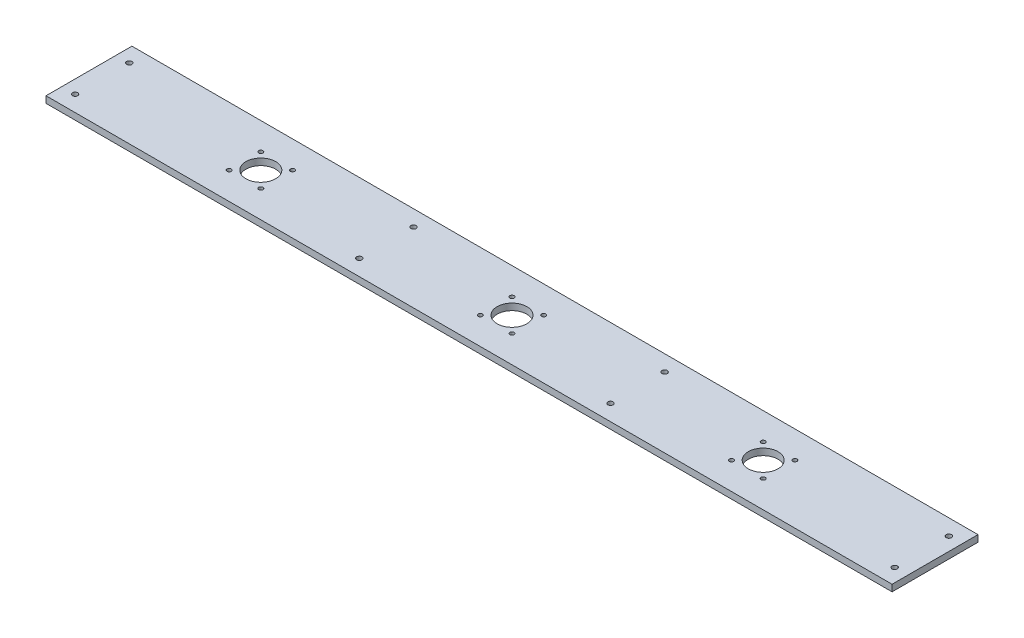
ISO-10303-21;
HEADER;
FILE_DESCRIPTION(('STEP AP214'),'2;1');
FILE_NAME('part.step','',(''),(''),'','','');
FILE_SCHEMA(('AUTOMOTIVE_DESIGN { 1 0 10303 214 1 1 1 1 }'));
ENDSEC;
DATA;
#1=APPLICATION_CONTEXT('core data for automotive mechanical design processes');
#2=APPLICATION_PROTOCOL_DEFINITION('international standard','automotive_design',2000,#1);
#3=PRODUCT_CONTEXT('',#1,'mechanical');
#4=PRODUCT('Part','Part','',(#3));
#5=PRODUCT_RELATED_PRODUCT_CATEGORY('part','',(#4));
#6=PRODUCT_DEFINITION_FORMATION('','',#4);
#7=PRODUCT_DEFINITION_CONTEXT('part definition',#1,'design');
#8=PRODUCT_DEFINITION('design','',#6,#7);
#9=PRODUCT_DEFINITION_SHAPE('','',#8);
#10=(LENGTH_UNIT() NAMED_UNIT(*) SI_UNIT(.MILLI.,.METRE.));
#11=(NAMED_UNIT(*) PLANE_ANGLE_UNIT() SI_UNIT($,.RADIAN.));
#12=(NAMED_UNIT(*) SI_UNIT($,.STERADIAN.) SOLID_ANGLE_UNIT());
#13=UNCERTAINTY_MEASURE_WITH_UNIT(LENGTH_MEASURE(1.E-05),#10,'distance_accuracy_value','');
#14=(GEOMETRIC_REPRESENTATION_CONTEXT(3) GLOBAL_UNCERTAINTY_ASSIGNED_CONTEXT((#13)) GLOBAL_UNIT_ASSIGNED_CONTEXT((#10,
#11,#12)) REPRESENTATION_CONTEXT('',''));
#15=CARTESIAN_POINT('',(0.,0.,0.));
#16=DIRECTION('',(0.,0.,1.));
#17=DIRECTION('',(1.,0.,0.));
#18=AXIS2_PLACEMENT_3D('',#15,#16,#17);
#19=CARTESIAN_POINT('',(0.,-6.35,0.));
#20=DIRECTION('',(0.,-1.,0.));
#21=DIRECTION('',(0.,0.,-1.));
#22=AXIS2_PLACEMENT_3D('',#19,#20,#21);
#23=PLANE('',#22);
#24=CARTESIAN_POINT('',(256.54,-6.34999999999764,-15.24));
#25=DIRECTION('',(0.,1.,0.));
#26=DIRECTION('',(0.,0.,1.));
#27=AXIS2_PLACEMENT_3D('',#24,#25,#26);
#28=CIRCLE('',#27,2.032);
#29=CARTESIAN_POINT('',(256.54,-6.34999999999764,-13.208));
#30=VERTEX_POINT('',#29);
#31=EDGE_CURVE('E191',#30,#30,#28,.T.);
#32=ORIENTED_EDGE('',*,*,#31,.T.);
#33=EDGE_LOOP('',(#32));
#34=FACE_BOUND('',#33,.T.);
#35=CARTESIAN_POINT('',(226.06,-6.34999999999764,15.24));
#36=DIRECTION('',(0.,1.,0.));
#37=DIRECTION('',(0.,0.,1.));
#38=AXIS2_PLACEMENT_3D('',#35,#36,#37);
#39=CIRCLE('',#38,2.032);
#40=CARTESIAN_POINT('',(226.06,-6.34999999999764,17.272));
#41=VERTEX_POINT('',#40);
#42=EDGE_CURVE('E185',#41,#41,#39,.T.);
#43=ORIENTED_EDGE('',*,*,#42,.T.);
#44=EDGE_LOOP('',(#43));
#45=FACE_BOUND('',#44,.T.);
#46=CARTESIAN_POINT('',(241.3,-6.34999999999764,0.));
#47=DIRECTION('',(0.,1.,0.));
#48=DIRECTION('',(0.,0.,1.));
#49=AXIS2_PLACEMENT_3D('',#46,#47,#48);
#50=CIRCLE('',#49,14.2875);
#51=CARTESIAN_POINT('',(241.3,-6.34999999999764,14.2875));
#52=VERTEX_POINT('',#51);
#53=EDGE_CURVE('E179',#52,#52,#50,.T.);
#54=ORIENTED_EDGE('',*,*,#53,.T.);
#55=EDGE_LOOP('',(#54));
#56=FACE_BOUND('',#55,.T.);
#57=CARTESIAN_POINT('',(-15.24,-6.34999999999764,-15.24));
#58=DIRECTION('',(0.,1.,0.));
#59=DIRECTION('',(0.,0.,1.));
#60=AXIS2_PLACEMENT_3D('',#57,#58,#59);
#61=CIRCLE('',#60,2.032);
#62=CARTESIAN_POINT('',(-15.24,-6.34999999999764,-13.208));
#63=VERTEX_POINT('',#62);
#64=EDGE_CURVE('E176',#63,#63,#61,.T.);
#65=ORIENTED_EDGE('',*,*,#64,.T.);
#66=EDGE_LOOP('',(#65));
#67=FACE_BOUND('',#66,.T.);
#68=CARTESIAN_POINT('',(-15.24,-6.34999999999764,15.24));
#69=DIRECTION('',(0.,1.,0.));
#70=DIRECTION('',(0.,0.,1.));
#71=AXIS2_PLACEMENT_3D('',#68,#69,#70);
#72=CIRCLE('',#71,2.032);
#73=CARTESIAN_POINT('',(-15.24,-6.34999999999764,17.272));
#74=VERTEX_POINT('',#73);
#75=EDGE_CURVE('E173',#74,#74,#72,.T.);
#76=ORIENTED_EDGE('',*,*,#75,.T.);
#77=EDGE_LOOP('',(#76));
#78=FACE_BOUND('',#77,.T.);
#79=CARTESIAN_POINT('',(15.24,-6.34999999999764,15.24));
#80=DIRECTION('',(0.,1.,0.));
#81=DIRECTION('',(0.,0.,1.));
#82=AXIS2_PLACEMENT_3D('',#79,#80,#81);
#83=CIRCLE('',#82,2.032);
#84=CARTESIAN_POINT('',(15.24,-6.34999999999764,17.272));
#85=VERTEX_POINT('',#84);
#86=EDGE_CURVE('E170',#85,#85,#83,.T.);
#87=ORIENTED_EDGE('',*,*,#86,.T.);
#88=EDGE_LOOP('',(#87));
#89=FACE_BOUND('',#88,.T.);
#90=CARTESIAN_POINT('',(15.24,-6.34999999999764,-15.24));
#91=DIRECTION('',(0.,1.,0.));
#92=DIRECTION('',(0.,0.,1.));
#93=AXIS2_PLACEMENT_3D('',#90,#91,#92);
#94=CIRCLE('',#93,2.032);
#95=CARTESIAN_POINT('',(15.24,-6.34999999999764,-13.208));
#96=VERTEX_POINT('',#95);
#97=EDGE_CURVE('E167',#96,#96,#94,.T.);
#98=ORIENTED_EDGE('',*,*,#97,.T.);
#99=EDGE_LOOP('',(#98));
#100=FACE_BOUND('',#99,.T.);
#101=CARTESIAN_POINT('',(-256.54,-6.34999999999764,-15.24));
#102=DIRECTION('',(0.,1.,0.));
#103=DIRECTION('',(0.,0.,1.));
#104=AXIS2_PLACEMENT_3D('',#101,#102,#103);
#105=CIRCLE('',#104,2.032);
#106=CARTESIAN_POINT('',(-256.54,-6.34999999999764,-13.208));
#107=VERTEX_POINT('',#106);
#108=EDGE_CURVE('E164',#107,#107,#105,.T.);
#109=ORIENTED_EDGE('',*,*,#108,.T.);
#110=EDGE_LOOP('',(#109));
#111=FACE_BOUND('',#110,.T.);
#112=CARTESIAN_POINT('',(-226.06,-6.34999999999764,-15.24));
#113=DIRECTION('',(0.,1.,0.));
#114=DIRECTION('',(0.,0.,1.));
#115=AXIS2_PLACEMENT_3D('',#112,#113,#114);
#116=CIRCLE('',#115,2.032);
#117=CARTESIAN_POINT('',(-226.06,-6.34999999999764,-13.208));
#118=VERTEX_POINT('',#117);
#119=EDGE_CURVE('E161',#118,#118,#116,.T.);
#120=ORIENTED_EDGE('',*,*,#119,.T.);
#121=EDGE_LOOP('',(#120));
#122=FACE_BOUND('',#121,.T.);
#123=CARTESIAN_POINT('',(-226.06,-6.34999999999764,15.24));
#124=DIRECTION('',(0.,1.,0.));
#125=DIRECTION('',(0.,0.,1.));
#126=AXIS2_PLACEMENT_3D('',#123,#124,#125);
#127=CIRCLE('',#126,2.032);
#128=CARTESIAN_POINT('',(-226.06,-6.34999999999764,17.272));
#129=VERTEX_POINT('',#128);
#130=EDGE_CURVE('E158',#129,#129,#127,.T.);
#131=ORIENTED_EDGE('',*,*,#130,.T.);
#132=EDGE_LOOP('',(#131));
#133=FACE_BOUND('',#132,.T.);
#134=CARTESIAN_POINT('',(0.,-6.34999999999764,0.));
#135=DIRECTION('',(0.,1.,0.));
#136=DIRECTION('',(0.,0.,1.));
#137=AXIS2_PLACEMENT_3D('',#134,#135,#136);
#138=CIRCLE('',#137,14.2875);
#139=CARTESIAN_POINT('',(0.,-6.34999999999764,14.2875));
#140=VERTEX_POINT('',#139);
#141=EDGE_CURVE('E155',#140,#140,#138,.T.);
#142=ORIENTED_EDGE('',*,*,#141,.T.);
#143=EDGE_LOOP('',(#142));
#144=FACE_BOUND('',#143,.T.);
#145=CARTESIAN_POINT('',(-256.54,-6.34999999999764,15.24));
#146=DIRECTION('',(0.,1.,0.));
#147=DIRECTION('',(0.,0.,1.));
#148=AXIS2_PLACEMENT_3D('',#145,#146,#147);
#149=CIRCLE('',#148,2.032);
#150=CARTESIAN_POINT('',(-256.54,-6.34999999999764,17.272));
#151=VERTEX_POINT('',#150);
#152=EDGE_CURVE('E152',#151,#151,#149,.T.);
#153=ORIENTED_EDGE('',*,*,#152,.T.);
#154=EDGE_LOOP('',(#153));
#155=FACE_BOUND('',#154,.T.);
#156=CARTESIAN_POINT('',(-241.3,-6.34999999999764,0.));
#157=DIRECTION('',(0.,1.,0.));
#158=DIRECTION('',(0.,0.,1.));
#159=AXIS2_PLACEMENT_3D('',#156,#157,#158);
#160=CIRCLE('',#159,14.2875);
#161=CARTESIAN_POINT('',(-241.3,-6.34999999999764,14.2875));
#162=VERTEX_POINT('',#161);
#163=EDGE_CURVE('E66',#162,#162,#160,.T.);
#164=ORIENTED_EDGE('',*,*,#163,.T.);
#165=EDGE_LOOP('',(#164));
#166=FACE_BOUND('',#165,.T.);
#167=DIRECTION('',(-1.,0.,0.));
#168=VECTOR('',#167,1.);
#169=CARTESIAN_POINT('',(-299.116079656319,-6.35,41.275));
#170=LINE('',#169,#168);
#171=CARTESIAN_POINT('',(406.4,-6.35,41.275));
#172=VERTEX_POINT('',#171);
#173=CARTESIAN_POINT('',(-406.4,-6.35,41.275));
#174=VERTEX_POINT('',#173);
#175=EDGE_CURVE('E55',#172,#174,#170,.T.);
#176=ORIENTED_EDGE('',*,*,#175,.T.);
#177=DIRECTION('',(0.,0.,-1.));
#178=VECTOR('',#177,1.);
#179=CARTESIAN_POINT('',(-406.4,-6.35,9.525));
#180=LINE('',#179,#178);
#181=CARTESIAN_POINT('',(-406.4,-6.35,-41.275));
#182=VERTEX_POINT('',#181);
#183=EDGE_CURVE('E619',#174,#182,#180,.T.);
#184=ORIENTED_EDGE('',*,*,#183,.T.);
#185=DIRECTION('',(-1.,0.,0.));
#186=VECTOR('',#185,1.);
#187=CARTESIAN_POINT('',(0.,-6.35,-41.275));
#188=LINE('',#187,#186);
#189=CARTESIAN_POINT('',(406.4,-6.35,-41.275));
#190=VERTEX_POINT('',#189);
#191=EDGE_CURVE('E60',#190,#182,#188,.T.);
#192=ORIENTED_EDGE('',*,*,#191,.F.);
#193=DIRECTION('',(0.,0.,-1.));
#194=VECTOR('',#193,1.);
#195=CARTESIAN_POINT('',(406.4,-6.35,9.52499999999979));
#196=LINE('',#195,#194);
#197=EDGE_CURVE('E58',#172,#190,#196,.T.);
#198=ORIENTED_EDGE('',*,*,#197,.F.);
#199=EDGE_LOOP('',(#176,#184,#192,#198));
#200=FACE_BOUND('',#199,.T.);
#201=CARTESIAN_POINT('',(256.54,-6.34999999999764,15.24));
#202=DIRECTION('',(0.,1.,0.));
#203=DIRECTION('',(0.,0.,1.));
#204=AXIS2_PLACEMENT_3D('',#201,#202,#203);
#205=CIRCLE('',#204,2.032);
#206=CARTESIAN_POINT('',(256.54,-6.34999999999764,17.272));
#207=VERTEX_POINT('',#206);
#208=EDGE_CURVE('E182',#207,#207,#205,.T.);
#209=ORIENTED_EDGE('',*,*,#208,.T.);
#210=EDGE_LOOP('',(#209));
#211=FACE_BOUND('',#210,.T.);
#212=CARTESIAN_POINT('',(226.06,-6.34999999999764,-15.24));
#213=DIRECTION('',(0.,1.,0.));
#214=DIRECTION('',(0.,0.,1.));
#215=AXIS2_PLACEMENT_3D('',#212,#213,#214);
#216=CIRCLE('',#215,2.032);
#217=CARTESIAN_POINT('',(226.06,-6.34999999999764,-13.208));
#218=VERTEX_POINT('',#217);
#219=EDGE_CURVE('E188',#218,#218,#216,.T.);
#220=ORIENTED_EDGE('',*,*,#219,.T.);
#221=EDGE_LOOP('',(#220));
#222=FACE_BOUND('',#221,.T.);
#223=CARTESIAN_POINT('',(-393.7,-6.34999999999764,-26.035));
#224=DIRECTION('',(0.,1.,0.));
#225=DIRECTION('',(0.,0.,1.));
#226=AXIS2_PLACEMENT_3D('',#223,#224,#225);
#227=CIRCLE('',#226,2.54);
#228=CARTESIAN_POINT('',(-393.7,-6.34999999999764,-23.495));
#229=VERTEX_POINT('',#228);
#230=EDGE_CURVE('E194',#229,#229,#227,.T.);
#231=ORIENTED_EDGE('',*,*,#230,.T.);
#232=EDGE_LOOP('',(#231));
#233=FACE_BOUND('',#232,.T.);
#234=CARTESIAN_POINT('',(-120.65,-6.34999999999764,26.035));
#235=DIRECTION('',(0.,1.,0.));
#236=DIRECTION('',(0.,0.,1.));
#237=AXIS2_PLACEMENT_3D('',#234,#235,#236);
#238=CIRCLE('',#237,2.54);
#239=CARTESIAN_POINT('',(-120.65,-6.34999999999764,28.575));
#240=VERTEX_POINT('',#239);
#241=EDGE_CURVE('E197',#240,#240,#238,.T.);
#242=ORIENTED_EDGE('',*,*,#241,.T.);
#243=EDGE_LOOP('',(#242));
#244=FACE_BOUND('',#243,.T.);
#245=CARTESIAN_POINT('',(-120.65,-6.34999999999764,-26.035));
#246=DIRECTION('',(0.,1.,0.));
#247=DIRECTION('',(0.,0.,1.));
#248=AXIS2_PLACEMENT_3D('',#245,#246,#247);
#249=CIRCLE('',#248,2.54);
#250=CARTESIAN_POINT('',(-120.65,-6.34999999999764,-23.495));
#251=VERTEX_POINT('',#250);
#252=EDGE_CURVE('E200',#251,#251,#249,.T.);
#253=ORIENTED_EDGE('',*,*,#252,.T.);
#254=EDGE_LOOP('',(#253));
#255=FACE_BOUND('',#254,.T.);
#256=CARTESIAN_POINT('',(-393.7,-6.34999999999764,26.035));
#257=DIRECTION('',(0.,1.,0.));
#258=DIRECTION('',(0.,0.,1.));
#259=AXIS2_PLACEMENT_3D('',#256,#257,#258);
#260=CIRCLE('',#259,2.54);
#261=CARTESIAN_POINT('',(-393.7,-6.34999999999764,28.575));
#262=VERTEX_POINT('',#261);
#263=EDGE_CURVE('E203',#262,#262,#260,.T.);
#264=ORIENTED_EDGE('',*,*,#263,.T.);
#265=EDGE_LOOP('',(#264));
#266=FACE_BOUND('',#265,.T.);
#267=CARTESIAN_POINT('',(393.7,-6.34999999999764,-26.035));
#268=DIRECTION('',(0.,1.,0.));
#269=DIRECTION('',(0.,0.,1.));
#270=AXIS2_PLACEMENT_3D('',#267,#268,#269);
#271=CIRCLE('',#270,2.54);
#272=CARTESIAN_POINT('',(393.7,-6.34999999999764,-23.495));
#273=VERTEX_POINT('',#272);
#274=EDGE_CURVE('E206',#273,#273,#271,.T.);
#275=ORIENTED_EDGE('',*,*,#274,.T.);
#276=EDGE_LOOP('',(#275));
#277=FACE_BOUND('',#276,.T.);
#278=CARTESIAN_POINT('',(120.65,-6.34999999999764,26.035));
#279=DIRECTION('',(0.,1.,0.));
#280=DIRECTION('',(0.,0.,1.));
#281=AXIS2_PLACEMENT_3D('',#278,#279,#280);
#282=CIRCLE('',#281,2.54);
#283=CARTESIAN_POINT('',(120.65,-6.34999999999764,28.575));
#284=VERTEX_POINT('',#283);
#285=EDGE_CURVE('E209',#284,#284,#282,.T.);
#286=ORIENTED_EDGE('',*,*,#285,.T.);
#287=EDGE_LOOP('',(#286));
#288=FACE_BOUND('',#287,.T.);
#289=CARTESIAN_POINT('',(120.65,-6.34999999999764,-26.035));
#290=DIRECTION('',(0.,1.,0.));
#291=DIRECTION('',(0.,0.,1.));
#292=AXIS2_PLACEMENT_3D('',#289,#290,#291);
#293=CIRCLE('',#292,2.54);
#294=CARTESIAN_POINT('',(120.65,-6.34999999999764,-23.495));
#295=VERTEX_POINT('',#294);
#296=EDGE_CURVE('E211',#295,#295,#293,.T.);
#297=ORIENTED_EDGE('',*,*,#296,.T.);
#298=EDGE_LOOP('',(#297));
#299=FACE_BOUND('',#298,.T.);
#300=CARTESIAN_POINT('',(393.7,-6.34999999999764,26.035));
#301=DIRECTION('',(0.,1.,0.));
#302=DIRECTION('',(0.,0.,1.));
#303=AXIS2_PLACEMENT_3D('',#300,#301,#302);
#304=CIRCLE('',#303,2.54);
#305=CARTESIAN_POINT('',(393.7,-6.34999999999764,28.575));
#306=VERTEX_POINT('',#305);
#307=EDGE_CURVE('E20',#306,#306,#304,.T.);
#308=ORIENTED_EDGE('',*,*,#307,.T.);
#309=EDGE_LOOP('',(#308));
#310=FACE_BOUND('',#309,.T.);
#311=ADVANCED_FACE('F17',(#34,#45,#56,#67,#78,#89,#100,#111,#122,#133,#144,#155,#166,#200,#211,
#222,#233,#244,#255,#266,#277,#288,#299,#310),#23,.T.);
#312=CARTESIAN_POINT('',(393.7,500000.,26.035));
#313=DIRECTION('',(0.,1.,0.));
#314=DIRECTION('',(0.,0.,1.));
#315=AXIS2_PLACEMENT_3D('',#312,#313,#314);
#316=CYLINDRICAL_SURFACE('',#315,2.54);
#317=ORIENTED_EDGE('',*,*,#307,.F.);
#318=EDGE_LOOP('',(#317));
#319=FACE_BOUND('',#318,.T.);
#320=CARTESIAN_POINT('',(393.7,0.,26.035));
#321=DIRECTION('',(0.,1.,0.));
#322=DIRECTION('',(0.,0.,1.));
#323=AXIS2_PLACEMENT_3D('',#320,#321,#322);
#324=CIRCLE('',#323,2.54);
#325=CARTESIAN_POINT('',(393.7,0.,28.575));
#326=VERTEX_POINT('',#325);
#327=EDGE_CURVE('E147',#326,#326,#324,.T.);
#328=ORIENTED_EDGE('',*,*,#327,.T.);
#329=EDGE_LOOP('',(#328));
#330=FACE_BOUND('',#329,.T.);
#331=ADVANCED_FACE('F219',(#319,#330),#316,.F.);
#332=CARTESIAN_POINT('',(120.65,500000.,-26.035));
#333=DIRECTION('',(0.,1.,0.));
#334=DIRECTION('',(0.,0.,1.));
#335=AXIS2_PLACEMENT_3D('',#332,#333,#334);
#336=CYLINDRICAL_SURFACE('',#335,2.54);
#337=ORIENTED_EDGE('',*,*,#296,.F.);
#338=EDGE_LOOP('',(#337));
#339=FACE_BOUND('',#338,.T.);
#340=CARTESIAN_POINT('',(120.65,0.,-26.035));
#341=DIRECTION('',(0.,1.,0.));
#342=DIRECTION('',(0.,0.,1.));
#343=AXIS2_PLACEMENT_3D('',#340,#341,#342);
#344=CIRCLE('',#343,2.54);
#345=CARTESIAN_POINT('',(120.65,0.,-23.495));
#346=VERTEX_POINT('',#345);
#347=EDGE_CURVE('E144',#346,#346,#344,.T.);
#348=ORIENTED_EDGE('',*,*,#347,.T.);
#349=EDGE_LOOP('',(#348));
#350=FACE_BOUND('',#349,.T.);
#351=ADVANCED_FACE('F222',(#339,#350),#336,.F.);
#352=CARTESIAN_POINT('',(120.65,500000.,26.035));
#353=DIRECTION('',(0.,1.,0.));
#354=DIRECTION('',(0.,0.,1.));
#355=AXIS2_PLACEMENT_3D('',#352,#353,#354);
#356=CYLINDRICAL_SURFACE('',#355,2.54);
#357=ORIENTED_EDGE('',*,*,#285,.F.);
#358=EDGE_LOOP('',(#357));
#359=FACE_BOUND('',#358,.T.);
#360=CARTESIAN_POINT('',(120.65,0.,26.035));
#361=DIRECTION('',(0.,1.,0.));
#362=DIRECTION('',(0.,0.,1.));
#363=AXIS2_PLACEMENT_3D('',#360,#361,#362);
#364=CIRCLE('',#363,2.54);
#365=CARTESIAN_POINT('',(120.65,0.,28.575));
#366=VERTEX_POINT('',#365);
#367=EDGE_CURVE('E141',#366,#366,#364,.T.);
#368=ORIENTED_EDGE('',*,*,#367,.T.);
#369=EDGE_LOOP('',(#368));
#370=FACE_BOUND('',#369,.T.);
#371=ADVANCED_FACE('F325',(#359,#370),#356,.F.);
#372=CARTESIAN_POINT('',(393.7,500000.,-26.035));
#373=DIRECTION('',(0.,1.,0.));
#374=DIRECTION('',(0.,0.,1.));
#375=AXIS2_PLACEMENT_3D('',#372,#373,#374);
#376=CYLINDRICAL_SURFACE('',#375,2.54);
#377=ORIENTED_EDGE('',*,*,#274,.F.);
#378=EDGE_LOOP('',(#377));
#379=FACE_BOUND('',#378,.T.);
#380=CARTESIAN_POINT('',(393.7,0.,-26.035));
#381=DIRECTION('',(0.,1.,0.));
#382=DIRECTION('',(0.,0.,1.));
#383=AXIS2_PLACEMENT_3D('',#380,#381,#382);
#384=CIRCLE('',#383,2.54);
#385=CARTESIAN_POINT('',(393.7,0.,-23.495));
#386=VERTEX_POINT('',#385);
#387=EDGE_CURVE('E138',#386,#386,#384,.T.);
#388=ORIENTED_EDGE('',*,*,#387,.T.);
#389=EDGE_LOOP('',(#388));
#390=FACE_BOUND('',#389,.T.);
#391=ADVANCED_FACE('F321',(#379,#390),#376,.F.);
#392=CARTESIAN_POINT('',(-393.7,500000.,26.035));
#393=DIRECTION('',(0.,1.,0.));
#394=DIRECTION('',(0.,0.,1.));
#395=AXIS2_PLACEMENT_3D('',#392,#393,#394);
#396=CYLINDRICAL_SURFACE('',#395,2.54);
#397=ORIENTED_EDGE('',*,*,#263,.F.);
#398=EDGE_LOOP('',(#397));
#399=FACE_BOUND('',#398,.T.);
#400=CARTESIAN_POINT('',(-393.7,0.,26.035));
#401=DIRECTION('',(0.,1.,0.));
#402=DIRECTION('',(0.,0.,1.));
#403=AXIS2_PLACEMENT_3D('',#400,#401,#402);
#404=CIRCLE('',#403,2.54);
#405=CARTESIAN_POINT('',(-393.7,0.,28.575));
#406=VERTEX_POINT('',#405);
#407=EDGE_CURVE('E135',#406,#406,#404,.T.);
#408=ORIENTED_EDGE('',*,*,#407,.T.);
#409=EDGE_LOOP('',(#408));
#410=FACE_BOUND('',#409,.T.);
#411=ADVANCED_FACE('F317',(#399,#410),#396,.F.);
#412=CARTESIAN_POINT('',(-120.65,500000.,-26.035));
#413=DIRECTION('',(0.,1.,0.));
#414=DIRECTION('',(0.,0.,1.));
#415=AXIS2_PLACEMENT_3D('',#412,#413,#414);
#416=CYLINDRICAL_SURFACE('',#415,2.54);
#417=ORIENTED_EDGE('',*,*,#252,.F.);
#418=EDGE_LOOP('',(#417));
#419=FACE_BOUND('',#418,.T.);
#420=CARTESIAN_POINT('',(-120.65,0.,-26.035));
#421=DIRECTION('',(0.,1.,0.));
#422=DIRECTION('',(0.,0.,1.));
#423=AXIS2_PLACEMENT_3D('',#420,#421,#422);
#424=CIRCLE('',#423,2.54);
#425=CARTESIAN_POINT('',(-120.65,0.,-23.495));
#426=VERTEX_POINT('',#425);
#427=EDGE_CURVE('E132',#426,#426,#424,.T.);
#428=ORIENTED_EDGE('',*,*,#427,.T.);
#429=EDGE_LOOP('',(#428));
#430=FACE_BOUND('',#429,.T.);
#431=ADVANCED_FACE('F313',(#419,#430),#416,.F.);
#432=CARTESIAN_POINT('',(-120.65,500000.,26.035));
#433=DIRECTION('',(0.,1.,0.));
#434=DIRECTION('',(0.,0.,1.));
#435=AXIS2_PLACEMENT_3D('',#432,#433,#434);
#436=CYLINDRICAL_SURFACE('',#435,2.54);
#437=ORIENTED_EDGE('',*,*,#241,.F.);
#438=EDGE_LOOP('',(#437));
#439=FACE_BOUND('',#438,.T.);
#440=CARTESIAN_POINT('',(-120.65,0.,26.035));
#441=DIRECTION('',(0.,1.,0.));
#442=DIRECTION('',(0.,0.,1.));
#443=AXIS2_PLACEMENT_3D('',#440,#441,#442);
#444=CIRCLE('',#443,2.54);
#445=CARTESIAN_POINT('',(-120.65,0.,28.575));
#446=VERTEX_POINT('',#445);
#447=EDGE_CURVE('E129',#446,#446,#444,.T.);
#448=ORIENTED_EDGE('',*,*,#447,.T.);
#449=EDGE_LOOP('',(#448));
#450=FACE_BOUND('',#449,.T.);
#451=ADVANCED_FACE('F309',(#439,#450),#436,.F.);
#452=CARTESIAN_POINT('',(-393.7,500000.,-26.035));
#453=DIRECTION('',(0.,1.,0.));
#454=DIRECTION('',(0.,0.,1.));
#455=AXIS2_PLACEMENT_3D('',#452,#453,#454);
#456=CYLINDRICAL_SURFACE('',#455,2.54);
#457=ORIENTED_EDGE('',*,*,#230,.F.);
#458=EDGE_LOOP('',(#457));
#459=FACE_BOUND('',#458,.T.);
#460=CARTESIAN_POINT('',(-393.7,0.,-26.035));
#461=DIRECTION('',(0.,1.,0.));
#462=DIRECTION('',(0.,0.,1.));
#463=AXIS2_PLACEMENT_3D('',#460,#461,#462);
#464=CIRCLE('',#463,2.54);
#465=CARTESIAN_POINT('',(-393.7,0.,-23.495));
#466=VERTEX_POINT('',#465);
#467=EDGE_CURVE('E126',#466,#466,#464,.T.);
#468=ORIENTED_EDGE('',*,*,#467,.T.);
#469=EDGE_LOOP('',(#468));
#470=FACE_BOUND('',#469,.T.);
#471=ADVANCED_FACE('F305',(#459,#470),#456,.F.);
#472=CARTESIAN_POINT('',(256.54,500000.,-15.24));
#473=DIRECTION('',(0.,1.,0.));
#474=DIRECTION('',(0.,0.,1.));
#475=AXIS2_PLACEMENT_3D('',#472,#473,#474);
#476=CYLINDRICAL_SURFACE('',#475,2.032);
#477=ORIENTED_EDGE('',*,*,#31,.F.);
#478=EDGE_LOOP('',(#477));
#479=FACE_BOUND('',#478,.T.);
#480=CARTESIAN_POINT('',(256.54,0.,-15.24));
#481=DIRECTION('',(0.,1.,0.));
#482=DIRECTION('',(0.,0.,1.));
#483=AXIS2_PLACEMENT_3D('',#480,#481,#482);
#484=CIRCLE('',#483,2.032);
#485=CARTESIAN_POINT('',(256.54,0.,-13.208));
#486=VERTEX_POINT('',#485);
#487=EDGE_CURVE('E123',#486,#486,#484,.T.);
#488=ORIENTED_EDGE('',*,*,#487,.T.);
#489=EDGE_LOOP('',(#488));
#490=FACE_BOUND('',#489,.T.);
#491=ADVANCED_FACE('F301',(#479,#490),#476,.F.);
#492=CARTESIAN_POINT('',(226.06,500000.,-15.24));
#493=DIRECTION('',(0.,1.,0.));
#494=DIRECTION('',(0.,0.,1.));
#495=AXIS2_PLACEMENT_3D('',#492,#493,#494);
#496=CYLINDRICAL_SURFACE('',#495,2.032);
#497=ORIENTED_EDGE('',*,*,#219,.F.);
#498=EDGE_LOOP('',(#497));
#499=FACE_BOUND('',#498,.T.);
#500=CARTESIAN_POINT('',(226.06,0.,-15.24));
#501=DIRECTION('',(0.,1.,0.));
#502=DIRECTION('',(0.,0.,1.));
#503=AXIS2_PLACEMENT_3D('',#500,#501,#502);
#504=CIRCLE('',#503,2.032);
#505=CARTESIAN_POINT('',(226.06,0.,-13.208));
#506=VERTEX_POINT('',#505);
#507=EDGE_CURVE('E120',#506,#506,#504,.T.);
#508=ORIENTED_EDGE('',*,*,#507,.T.);
#509=EDGE_LOOP('',(#508));
#510=FACE_BOUND('',#509,.T.);
#511=ADVANCED_FACE('F297',(#499,#510),#496,.F.);
#512=CARTESIAN_POINT('',(226.06,500000.,15.24));
#513=DIRECTION('',(0.,1.,0.));
#514=DIRECTION('',(0.,0.,1.));
#515=AXIS2_PLACEMENT_3D('',#512,#513,#514);
#516=CYLINDRICAL_SURFACE('',#515,2.032);
#517=ORIENTED_EDGE('',*,*,#42,.F.);
#518=EDGE_LOOP('',(#517));
#519=FACE_BOUND('',#518,.T.);
#520=CARTESIAN_POINT('',(226.06,0.,15.24));
#521=DIRECTION('',(0.,1.,0.));
#522=DIRECTION('',(0.,0.,1.));
#523=AXIS2_PLACEMENT_3D('',#520,#521,#522);
#524=CIRCLE('',#523,2.032);
#525=CARTESIAN_POINT('',(226.06,0.,17.272));
#526=VERTEX_POINT('',#525);
#527=EDGE_CURVE('E117',#526,#526,#524,.T.);
#528=ORIENTED_EDGE('',*,*,#527,.T.);
#529=EDGE_LOOP('',(#528));
#530=FACE_BOUND('',#529,.T.);
#531=ADVANCED_FACE('F293',(#519,#530),#516,.F.);
#532=CARTESIAN_POINT('',(256.54,500000.,15.24));
#533=DIRECTION('',(0.,1.,0.));
#534=DIRECTION('',(0.,0.,1.));
#535=AXIS2_PLACEMENT_3D('',#532,#533,#534);
#536=CYLINDRICAL_SURFACE('',#535,2.032);
#537=ORIENTED_EDGE('',*,*,#208,.F.);
#538=EDGE_LOOP('',(#537));
#539=FACE_BOUND('',#538,.T.);
#540=CARTESIAN_POINT('',(256.54,0.,15.24));
#541=DIRECTION('',(0.,1.,0.));
#542=DIRECTION('',(0.,0.,1.));
#543=AXIS2_PLACEMENT_3D('',#540,#541,#542);
#544=CIRCLE('',#543,2.032);
#545=CARTESIAN_POINT('',(256.54,0.,17.272));
#546=VERTEX_POINT('',#545);
#547=EDGE_CURVE('E114',#546,#546,#544,.T.);
#548=ORIENTED_EDGE('',*,*,#547,.T.);
#549=EDGE_LOOP('',(#548));
#550=FACE_BOUND('',#549,.T.);
#551=ADVANCED_FACE('F289',(#539,#550),#536,.F.);
#552=CARTESIAN_POINT('',(241.3,500000.,0.));
#553=DIRECTION('',(0.,1.,0.));
#554=DIRECTION('',(0.,0.,1.));
#555=AXIS2_PLACEMENT_3D('',#552,#553,#554);
#556=CYLINDRICAL_SURFACE('',#555,14.2875);
#557=ORIENTED_EDGE('',*,*,#53,.F.);
#558=EDGE_LOOP('',(#557));
#559=FACE_BOUND('',#558,.T.);
#560=CARTESIAN_POINT('',(241.3,0.,0.));
#561=DIRECTION('',(0.,1.,0.));
#562=DIRECTION('',(0.,0.,1.));
#563=AXIS2_PLACEMENT_3D('',#560,#561,#562);
#564=CIRCLE('',#563,14.2875);
#565=CARTESIAN_POINT('',(241.3,0.,14.2875));
#566=VERTEX_POINT('',#565);
#567=EDGE_CURVE('E111',#566,#566,#564,.T.);
#568=ORIENTED_EDGE('',*,*,#567,.T.);
#569=EDGE_LOOP('',(#568));
#570=FACE_BOUND('',#569,.T.);
#571=ADVANCED_FACE('F285',(#559,#570),#556,.F.);
#572=CARTESIAN_POINT('',(-15.24,500000.,-15.24));
#573=DIRECTION('',(0.,1.,0.));
#574=DIRECTION('',(0.,0.,1.));
#575=AXIS2_PLACEMENT_3D('',#572,#573,#574);
#576=CYLINDRICAL_SURFACE('',#575,2.032);
#577=ORIENTED_EDGE('',*,*,#64,.F.);
#578=EDGE_LOOP('',(#577));
#579=FACE_BOUND('',#578,.T.);
#580=CARTESIAN_POINT('',(-15.24,0.,-15.24));
#581=DIRECTION('',(0.,1.,0.));
#582=DIRECTION('',(0.,0.,1.));
#583=AXIS2_PLACEMENT_3D('',#580,#581,#582);
#584=CIRCLE('',#583,2.032);
#585=CARTESIAN_POINT('',(-15.24,0.,-13.208));
#586=VERTEX_POINT('',#585);
#587=EDGE_CURVE('E108',#586,#586,#584,.T.);
#588=ORIENTED_EDGE('',*,*,#587,.T.);
#589=EDGE_LOOP('',(#588));
#590=FACE_BOUND('',#589,.T.);
#591=ADVANCED_FACE('F281',(#579,#590),#576,.F.);
#592=CARTESIAN_POINT('',(-15.24,500000.,15.24));
#593=DIRECTION('',(0.,1.,0.));
#594=DIRECTION('',(0.,0.,1.));
#595=AXIS2_PLACEMENT_3D('',#592,#593,#594);
#596=CYLINDRICAL_SURFACE('',#595,2.032);
#597=ORIENTED_EDGE('',*,*,#75,.F.);
#598=EDGE_LOOP('',(#597));
#599=FACE_BOUND('',#598,.T.);
#600=CARTESIAN_POINT('',(-15.24,0.,15.24));
#601=DIRECTION('',(0.,1.,0.));
#602=DIRECTION('',(0.,0.,1.));
#603=AXIS2_PLACEMENT_3D('',#600,#601,#602);
#604=CIRCLE('',#603,2.032);
#605=CARTESIAN_POINT('',(-15.24,0.,17.272));
#606=VERTEX_POINT('',#605);
#607=EDGE_CURVE('E105',#606,#606,#604,.T.);
#608=ORIENTED_EDGE('',*,*,#607,.T.);
#609=EDGE_LOOP('',(#608));
#610=FACE_BOUND('',#609,.T.);
#611=ADVANCED_FACE('F277',(#599,#610),#596,.F.);
#612=CARTESIAN_POINT('',(15.24,500000.,15.24));
#613=DIRECTION('',(0.,1.,0.));
#614=DIRECTION('',(0.,0.,1.));
#615=AXIS2_PLACEMENT_3D('',#612,#613,#614);
#616=CYLINDRICAL_SURFACE('',#615,2.032);
#617=ORIENTED_EDGE('',*,*,#86,.F.);
#618=EDGE_LOOP('',(#617));
#619=FACE_BOUND('',#618,.T.);
#620=CARTESIAN_POINT('',(15.24,0.,15.24));
#621=DIRECTION('',(0.,1.,0.));
#622=DIRECTION('',(0.,0.,1.));
#623=AXIS2_PLACEMENT_3D('',#620,#621,#622);
#624=CIRCLE('',#623,2.032);
#625=CARTESIAN_POINT('',(15.24,0.,17.272));
#626=VERTEX_POINT('',#625);
#627=EDGE_CURVE('E102',#626,#626,#624,.T.);
#628=ORIENTED_EDGE('',*,*,#627,.T.);
#629=EDGE_LOOP('',(#628));
#630=FACE_BOUND('',#629,.T.);
#631=ADVANCED_FACE('F273',(#619,#630),#616,.F.);
#632=CARTESIAN_POINT('',(15.24,500000.,-15.24));
#633=DIRECTION('',(0.,1.,0.));
#634=DIRECTION('',(0.,0.,1.));
#635=AXIS2_PLACEMENT_3D('',#632,#633,#634);
#636=CYLINDRICAL_SURFACE('',#635,2.032);
#637=ORIENTED_EDGE('',*,*,#97,.F.);
#638=EDGE_LOOP('',(#637));
#639=FACE_BOUND('',#638,.T.);
#640=CARTESIAN_POINT('',(15.24,0.,-15.24));
#641=DIRECTION('',(0.,1.,0.));
#642=DIRECTION('',(0.,0.,1.));
#643=AXIS2_PLACEMENT_3D('',#640,#641,#642);
#644=CIRCLE('',#643,2.032);
#645=CARTESIAN_POINT('',(15.24,0.,-13.208));
#646=VERTEX_POINT('',#645);
#647=EDGE_CURVE('E99',#646,#646,#644,.T.);
#648=ORIENTED_EDGE('',*,*,#647,.T.);
#649=EDGE_LOOP('',(#648));
#650=FACE_BOUND('',#649,.T.);
#651=ADVANCED_FACE('F269',(#639,#650),#636,.F.);
#652=CARTESIAN_POINT('',(-256.54,500000.,-15.24));
#653=DIRECTION('',(0.,1.,0.));
#654=DIRECTION('',(0.,0.,1.));
#655=AXIS2_PLACEMENT_3D('',#652,#653,#654);
#656=CYLINDRICAL_SURFACE('',#655,2.032);
#657=ORIENTED_EDGE('',*,*,#108,.F.);
#658=EDGE_LOOP('',(#657));
#659=FACE_BOUND('',#658,.T.);
#660=CARTESIAN_POINT('',(-256.54,0.,-15.24));
#661=DIRECTION('',(0.,1.,0.));
#662=DIRECTION('',(0.,0.,1.));
#663=AXIS2_PLACEMENT_3D('',#660,#661,#662);
#664=CIRCLE('',#663,2.032);
#665=CARTESIAN_POINT('',(-256.54,0.,-13.208));
#666=VERTEX_POINT('',#665);
#667=EDGE_CURVE('E96',#666,#666,#664,.T.);
#668=ORIENTED_EDGE('',*,*,#667,.T.);
#669=EDGE_LOOP('',(#668));
#670=FACE_BOUND('',#669,.T.);
#671=ADVANCED_FACE('F265',(#659,#670),#656,.F.);
#672=CARTESIAN_POINT('',(-226.06,500000.,-15.24));
#673=DIRECTION('',(0.,1.,0.));
#674=DIRECTION('',(0.,0.,1.));
#675=AXIS2_PLACEMENT_3D('',#672,#673,#674);
#676=CYLINDRICAL_SURFACE('',#675,2.032);
#677=ORIENTED_EDGE('',*,*,#119,.F.);
#678=EDGE_LOOP('',(#677));
#679=FACE_BOUND('',#678,.T.);
#680=CARTESIAN_POINT('',(-226.06,0.,-15.24));
#681=DIRECTION('',(0.,1.,0.));
#682=DIRECTION('',(0.,0.,1.));
#683=AXIS2_PLACEMENT_3D('',#680,#681,#682);
#684=CIRCLE('',#683,2.032);
#685=CARTESIAN_POINT('',(-226.06,0.,-13.208));
#686=VERTEX_POINT('',#685);
#687=EDGE_CURVE('E93',#686,#686,#684,.T.);
#688=ORIENTED_EDGE('',*,*,#687,.T.);
#689=EDGE_LOOP('',(#688));
#690=FACE_BOUND('',#689,.T.);
#691=ADVANCED_FACE('F261',(#679,#690),#676,.F.);
#692=CARTESIAN_POINT('',(-226.06,500000.,15.24));
#693=DIRECTION('',(0.,1.,0.));
#694=DIRECTION('',(0.,0.,1.));
#695=AXIS2_PLACEMENT_3D('',#692,#693,#694);
#696=CYLINDRICAL_SURFACE('',#695,2.032);
#697=ORIENTED_EDGE('',*,*,#130,.F.);
#698=EDGE_LOOP('',(#697));
#699=FACE_BOUND('',#698,.T.);
#700=CARTESIAN_POINT('',(-226.06,0.,15.24));
#701=DIRECTION('',(0.,1.,0.));
#702=DIRECTION('',(0.,0.,1.));
#703=AXIS2_PLACEMENT_3D('',#700,#701,#702);
#704=CIRCLE('',#703,2.032);
#705=CARTESIAN_POINT('',(-226.06,0.,17.272));
#706=VERTEX_POINT('',#705);
#707=EDGE_CURVE('E90',#706,#706,#704,.T.);
#708=ORIENTED_EDGE('',*,*,#707,.T.);
#709=EDGE_LOOP('',(#708));
#710=FACE_BOUND('',#709,.T.);
#711=ADVANCED_FACE('F257',(#699,#710),#696,.F.);
#712=CARTESIAN_POINT('',(0.,500000.,0.));
#713=DIRECTION('',(0.,1.,0.));
#714=DIRECTION('',(0.,0.,1.));
#715=AXIS2_PLACEMENT_3D('',#712,#713,#714);
#716=CYLINDRICAL_SURFACE('',#715,14.2875);
#717=ORIENTED_EDGE('',*,*,#141,.F.);
#718=EDGE_LOOP('',(#717));
#719=FACE_BOUND('',#718,.T.);
#720=CARTESIAN_POINT('',(0.,0.,0.));
#721=DIRECTION('',(0.,1.,0.));
#722=DIRECTION('',(0.,0.,1.));
#723=AXIS2_PLACEMENT_3D('',#720,#721,#722);
#724=CIRCLE('',#723,14.2875);
#725=CARTESIAN_POINT('',(0.,0.,14.2875));
#726=VERTEX_POINT('',#725);
#727=EDGE_CURVE('E87',#726,#726,#724,.T.);
#728=ORIENTED_EDGE('',*,*,#727,.T.);
#729=EDGE_LOOP('',(#728));
#730=FACE_BOUND('',#729,.T.);
#731=ADVANCED_FACE('F253',(#719,#730),#716,.F.);
#732=CARTESIAN_POINT('',(-256.54,500000.,15.24));
#733=DIRECTION('',(0.,1.,0.));
#734=DIRECTION('',(0.,0.,1.));
#735=AXIS2_PLACEMENT_3D('',#732,#733,#734);
#736=CYLINDRICAL_SURFACE('',#735,2.032);
#737=ORIENTED_EDGE('',*,*,#152,.F.);
#738=EDGE_LOOP('',(#737));
#739=FACE_BOUND('',#738,.T.);
#740=CARTESIAN_POINT('',(-256.54,0.,15.24));
#741=DIRECTION('',(0.,1.,0.));
#742=DIRECTION('',(0.,0.,1.));
#743=AXIS2_PLACEMENT_3D('',#740,#741,#742);
#744=CIRCLE('',#743,2.032);
#745=CARTESIAN_POINT('',(-256.54,0.,17.272));
#746=VERTEX_POINT('',#745);
#747=EDGE_CURVE('E84',#746,#746,#744,.T.);
#748=ORIENTED_EDGE('',*,*,#747,.T.);
#749=EDGE_LOOP('',(#748));
#750=FACE_BOUND('',#749,.T.);
#751=ADVANCED_FACE('F249',(#739,#750),#736,.F.);
#752=CARTESIAN_POINT('',(-241.3,500000.,0.));
#753=DIRECTION('',(0.,1.,0.));
#754=DIRECTION('',(0.,0.,1.));
#755=AXIS2_PLACEMENT_3D('',#752,#753,#754);
#756=CYLINDRICAL_SURFACE('',#755,14.2875);
#757=ORIENTED_EDGE('',*,*,#163,.F.);
#758=EDGE_LOOP('',(#757));
#759=FACE_BOUND('',#758,.T.);
#760=CARTESIAN_POINT('',(-241.3,0.,0.));
#761=DIRECTION('',(0.,1.,0.));
#762=DIRECTION('',(0.,0.,1.));
#763=AXIS2_PLACEMENT_3D('',#760,#761,#762);
#764=CIRCLE('',#763,14.2875);
#765=CARTESIAN_POINT('',(-241.3,0.,14.2875));
#766=VERTEX_POINT('',#765);
#767=EDGE_CURVE('E81',#766,#766,#764,.T.);
#768=ORIENTED_EDGE('',*,*,#767,.T.);
#769=EDGE_LOOP('',(#768));
#770=FACE_BOUND('',#769,.T.);
#771=ADVANCED_FACE('F246',(#759,#770),#756,.F.);
#772=CARTESIAN_POINT('',(406.4,-6.35,9.52499999999979));
#773=DIRECTION('',(1.,0.,0.));
#774=DIRECTION('',(0.,0.,-1.));
#775=AXIS2_PLACEMENT_3D('',#772,#773,#774);
#776=PLANE('',#775);
#777=ORIENTED_EDGE('',*,*,#197,.T.);
#778=DIRECTION('',(0.,1.,0.));
#779=VECTOR('',#778,1.);
#780=CARTESIAN_POINT('',(406.4,-6.35,-41.275));
#781=LINE('',#780,#779);
#782=CARTESIAN_POINT('',(406.4,0.,-41.275));
#783=VERTEX_POINT('',#782);
#784=EDGE_CURVE('E621',#783,#190,#781,.F.);
#785=ORIENTED_EDGE('',*,*,#784,.F.);
#786=DIRECTION('',(0.,0.,-1.));
#787=VECTOR('',#786,1.);
#788=CARTESIAN_POINT('',(406.4,0.,0.));
#789=LINE('',#788,#787);
#790=CARTESIAN_POINT('',(406.4,0.,41.275));
#791=VERTEX_POINT('',#790);
#792=EDGE_CURVE('E77',#783,#791,#789,.F.);
#793=ORIENTED_EDGE('',*,*,#792,.T.);
#794=DIRECTION('',(0.,1.,0.));
#795=VECTOR('',#794,1.);
#796=CARTESIAN_POINT('',(406.4,-6.35,41.275));
#797=LINE('',#796,#795);
#798=EDGE_CURVE('E65',#791,#172,#797,.F.);
#799=ORIENTED_EDGE('',*,*,#798,.T.);
#800=EDGE_LOOP('',(#777,#785,#793,#799));
#801=FACE_BOUND('',#800,.T.);
#802=ADVANCED_FACE('F76',(#801),#776,.T.);
#803=CARTESIAN_POINT('',(-299.116079656319,-6.35,41.275));
#804=DIRECTION('',(0.,0.,-1.));
#805=DIRECTION('',(-1.,0.,0.));
#806=AXIS2_PLACEMENT_3D('',#803,#804,#805);
#807=PLANE('',#806);
#808=DIRECTION('',(0.,1.,0.));
#809=VECTOR('',#808,1.);
#810=CARTESIAN_POINT('',(-406.4,-6.35,41.275));
#811=LINE('',#810,#809);
#812=CARTESIAN_POINT('',(-406.4,0.,41.275));
#813=VERTEX_POINT('',#812);
#814=EDGE_CURVE('E73',#813,#174,#811,.F.);
#815=ORIENTED_EDGE('',*,*,#814,.T.);
#816=ORIENTED_EDGE('',*,*,#175,.F.);
#817=ORIENTED_EDGE('',*,*,#798,.F.);
#818=DIRECTION('',(1.,0.,0.));
#819=VECTOR('',#818,1.);
#820=CARTESIAN_POINT('',(0.,0.,41.275));
#821=LINE('',#820,#819);
#822=EDGE_CURVE('E627',#791,#813,#821,.F.);
#823=ORIENTED_EDGE('',*,*,#822,.T.);
#824=EDGE_LOOP('',(#815,#816,#817,#823));
#825=FACE_BOUND('',#824,.T.);
#826=ADVANCED_FACE('F70',(#825),#807,.F.);
#827=CARTESIAN_POINT('',(-406.4,-6.35,9.525));
#828=DIRECTION('',(1.,0.,0.));
#829=DIRECTION('',(0.,0.,-1.));
#830=AXIS2_PLACEMENT_3D('',#827,#828,#829);
#831=PLANE('',#830);
#832=DIRECTION('',(0.,1.,0.));
#833=VECTOR('',#832,1.);
#834=CARTESIAN_POINT('',(-406.4,-6.35,-41.275));
#835=LINE('',#834,#833);
#836=CARTESIAN_POINT('',(-406.4,0.,-41.275));
#837=VERTEX_POINT('',#836);
#838=EDGE_CURVE('E34',#182,#837,#835,.T.);
#839=ORIENTED_EDGE('',*,*,#838,.F.);
#840=ORIENTED_EDGE('',*,*,#183,.F.);
#841=ORIENTED_EDGE('',*,*,#814,.F.);
#842=DIRECTION('',(0.,0.,-1.));
#843=VECTOR('',#842,1.);
#844=CARTESIAN_POINT('',(-406.4,0.,0.));
#845=LINE('',#844,#843);
#846=EDGE_CURVE('E26',#813,#837,#845,.T.);
#847=ORIENTED_EDGE('',*,*,#846,.T.);
#848=EDGE_LOOP('',(#839,#840,#841,#847));
#849=FACE_BOUND('',#848,.T.);
#850=ADVANCED_FACE('F234',(#849),#831,.F.);
#851=CARTESIAN_POINT('',(0.,-6.35,-41.275));
#852=DIRECTION('',(0.,0.,-1.));
#853=DIRECTION('',(-1.,0.,0.));
#854=AXIS2_PLACEMENT_3D('',#851,#852,#853);
#855=PLANE('',#854);
#856=ORIENTED_EDGE('',*,*,#191,.T.);
#857=ORIENTED_EDGE('',*,*,#838,.T.);
#858=DIRECTION('',(1.,0.,0.));
#859=VECTOR('',#858,1.);
#860=CARTESIAN_POINT('',(0.,0.,-41.275));
#861=LINE('',#860,#859);
#862=EDGE_CURVE('E11',#837,#783,#861,.T.);
#863=ORIENTED_EDGE('',*,*,#862,.T.);
#864=ORIENTED_EDGE('',*,*,#784,.T.);
#865=EDGE_LOOP('',(#856,#857,#863,#864));
#866=FACE_BOUND('',#865,.T.);
#867=ADVANCED_FACE('F227',(#866),#855,.T.);
#868=CARTESIAN_POINT('',(0.,0.,0.));
#869=DIRECTION('',(0.,-1.,0.));
#870=DIRECTION('',(0.,0.,-1.));
#871=AXIS2_PLACEMENT_3D('',#868,#869,#870);
#872=PLANE('',#871);
#873=ORIENTED_EDGE('',*,*,#846,.F.);
#874=ORIENTED_EDGE('',*,*,#822,.F.);
#875=ORIENTED_EDGE('',*,*,#792,.F.);
#876=ORIENTED_EDGE('',*,*,#862,.F.);
#877=EDGE_LOOP('',(#873,#874,#875,#876));
#878=FACE_BOUND('',#877,.T.);
#879=ORIENTED_EDGE('',*,*,#767,.F.);
#880=EDGE_LOOP('',(#879));
#881=FACE_BOUND('',#880,.T.);
#882=ORIENTED_EDGE('',*,*,#747,.F.);
#883=EDGE_LOOP('',(#882));
#884=FACE_BOUND('',#883,.T.);
#885=ORIENTED_EDGE('',*,*,#727,.F.);
#886=EDGE_LOOP('',(#885));
#887=FACE_BOUND('',#886,.T.);
#888=ORIENTED_EDGE('',*,*,#707,.F.);
#889=EDGE_LOOP('',(#888));
#890=FACE_BOUND('',#889,.T.);
#891=ORIENTED_EDGE('',*,*,#687,.F.);
#892=EDGE_LOOP('',(#891));
#893=FACE_BOUND('',#892,.T.);
#894=ORIENTED_EDGE('',*,*,#667,.F.);
#895=EDGE_LOOP('',(#894));
#896=FACE_BOUND('',#895,.T.);
#897=ORIENTED_EDGE('',*,*,#647,.F.);
#898=EDGE_LOOP('',(#897));
#899=FACE_BOUND('',#898,.T.);
#900=ORIENTED_EDGE('',*,*,#627,.F.);
#901=EDGE_LOOP('',(#900));
#902=FACE_BOUND('',#901,.T.);
#903=ORIENTED_EDGE('',*,*,#607,.F.);
#904=EDGE_LOOP('',(#903));
#905=FACE_BOUND('',#904,.T.);
#906=ORIENTED_EDGE('',*,*,#587,.F.);
#907=EDGE_LOOP('',(#906));
#908=FACE_BOUND('',#907,.T.);
#909=ORIENTED_EDGE('',*,*,#567,.F.);
#910=EDGE_LOOP('',(#909));
#911=FACE_BOUND('',#910,.T.);
#912=ORIENTED_EDGE('',*,*,#547,.F.);
#913=EDGE_LOOP('',(#912));
#914=FACE_BOUND('',#913,.T.);
#915=ORIENTED_EDGE('',*,*,#527,.F.);
#916=EDGE_LOOP('',(#915));
#917=FACE_BOUND('',#916,.T.);
#918=ORIENTED_EDGE('',*,*,#507,.F.);
#919=EDGE_LOOP('',(#918));
#920=FACE_BOUND('',#919,.T.);
#921=ORIENTED_EDGE('',*,*,#487,.F.);
#922=EDGE_LOOP('',(#921));
#923=FACE_BOUND('',#922,.T.);
#924=ORIENTED_EDGE('',*,*,#467,.F.);
#925=EDGE_LOOP('',(#924));
#926=FACE_BOUND('',#925,.T.);
#927=ORIENTED_EDGE('',*,*,#447,.F.);
#928=EDGE_LOOP('',(#927));
#929=FACE_BOUND('',#928,.T.);
#930=ORIENTED_EDGE('',*,*,#427,.F.);
#931=EDGE_LOOP('',(#930));
#932=FACE_BOUND('',#931,.T.);
#933=ORIENTED_EDGE('',*,*,#407,.F.);
#934=EDGE_LOOP('',(#933));
#935=FACE_BOUND('',#934,.T.);
#936=ORIENTED_EDGE('',*,*,#387,.F.);
#937=EDGE_LOOP('',(#936));
#938=FACE_BOUND('',#937,.T.);
#939=ORIENTED_EDGE('',*,*,#367,.F.);
#940=EDGE_LOOP('',(#939));
#941=FACE_BOUND('',#940,.T.);
#942=ORIENTED_EDGE('',*,*,#347,.F.);
#943=EDGE_LOOP('',(#942));
#944=FACE_BOUND('',#943,.T.);
#945=ORIENTED_EDGE('',*,*,#327,.F.);
#946=EDGE_LOOP('',(#945));
#947=FACE_BOUND('',#946,.T.);
#948=ADVANCED_FACE('F225',(#878,#881,#884,#887,#890,#893,#896,#899,#902,#905,#908,#911,#914,
#917,#920,#923,#926,#929,#932,#935,#938,#941,#944,#947),#872,.F.);
#949=CLOSED_SHELL('',(#311,#331,#351,#371,#391,#411,#431,#451,#471,#491,#511,#531,#551,#571,
#591,#611,#631,#651,#671,#691,#711,#731,#751,#771,#802,#826,#850,#867,#948));
#950=MANIFOLD_SOLID_BREP('B1',#949);
#951=ADVANCED_BREP_SHAPE_REPRESENTATION('',(#18,#950),#14);
#952=SHAPE_DEFINITION_REPRESENTATION(#9,#951);
ENDSEC;
END-ISO-10303-21;
